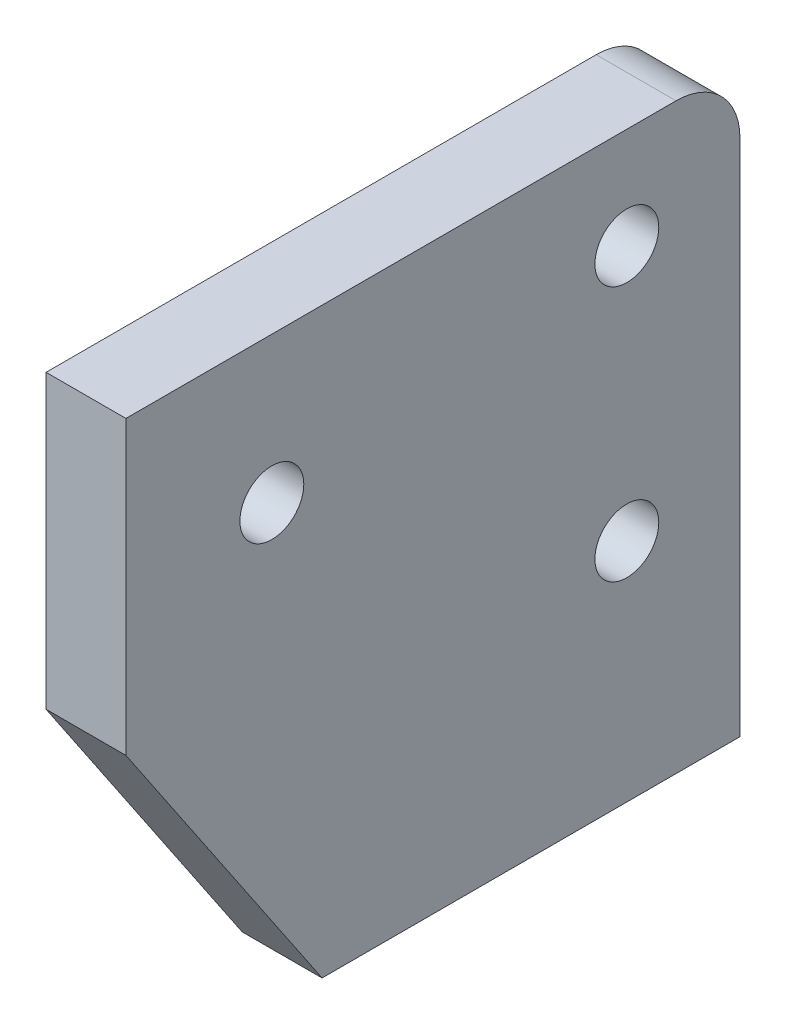
ISO-10303-21;
HEADER;
FILE_DESCRIPTION(('STEP AP214'),'2;1');
FILE_NAME('part.step','',(''),(''),'','','');
FILE_SCHEMA(('AUTOMOTIVE_DESIGN { 1 0 10303 214 1 1 1 1 }'));
ENDSEC;
DATA;
#1=APPLICATION_CONTEXT('core data for automotive mechanical design processes');
#2=APPLICATION_PROTOCOL_DEFINITION('international standard','automotive_design',2000,#1);
#3=PRODUCT_CONTEXT('',#1,'mechanical');
#4=PRODUCT('Part','Part','',(#3));
#5=PRODUCT_RELATED_PRODUCT_CATEGORY('part','',(#4));
#6=PRODUCT_DEFINITION_FORMATION('','',#4);
#7=PRODUCT_DEFINITION_CONTEXT('part definition',#1,'design');
#8=PRODUCT_DEFINITION('design','',#6,#7);
#9=PRODUCT_DEFINITION_SHAPE('','',#8);
#10=(LENGTH_UNIT() NAMED_UNIT(*) SI_UNIT(.MILLI.,.METRE.));
#11=(NAMED_UNIT(*) PLANE_ANGLE_UNIT() SI_UNIT($,.RADIAN.));
#12=(NAMED_UNIT(*) SI_UNIT($,.STERADIAN.) SOLID_ANGLE_UNIT());
#13=UNCERTAINTY_MEASURE_WITH_UNIT(LENGTH_MEASURE(1.E-05),#10,'distance_accuracy_value','');
#14=(GEOMETRIC_REPRESENTATION_CONTEXT(3) GLOBAL_UNCERTAINTY_ASSIGNED_CONTEXT((#13)) GLOBAL_UNIT_ASSIGNED_CONTEXT((#10,
#11,#12)) REPRESENTATION_CONTEXT('',''));
#15=CARTESIAN_POINT('',(0.,0.,0.));
#16=DIRECTION('',(0.,0.,1.));
#17=DIRECTION('',(1.,0.,0.));
#18=AXIS2_PLACEMENT_3D('',#15,#16,#17);
#19=CARTESIAN_POINT('',(3.175,0.,0.));
#20=DIRECTION('',(-1.,0.,0.));
#21=DIRECTION('',(0.,0.,1.));
#22=AXIS2_PLACEMENT_3D('',#19,#20,#21);
#23=PLANE('',#22);
#24=DIRECTION('',(0.,1.,0.));
#25=VECTOR('',#24,1.);
#26=CARTESIAN_POINT('',(3.175,2.62376219694305,-9.84014481352053));
#27=LINE('',#26,#25);
#28=CARTESIAN_POINT('',(3.175,2.62376219694305,-9.84014481352053));
#29=VERTEX_POINT('',#28);
#30=CARTESIAN_POINT('',(3.175,23.2498731492951,-9.84014481352053));
#31=VERTEX_POINT('',#30);
#32=EDGE_CURVE('E88',#29,#31,#27,.T.);
#33=ORIENTED_EDGE('',*,*,#32,.T.);
#34=CARTESIAN_POINT('',(3.175,23.2498731492951,-7.30014481352054));
#35=DIRECTION('',(-1.,0.,0.));
#36=DIRECTION('',(0.,0.,1.));
#37=AXIS2_PLACEMENT_3D('',#34,#35,#36);
#38=CIRCLE('',#37,2.54);
#39=CARTESIAN_POINT('',(3.175,25.7898731492951,-7.30014481352054));
#40=VERTEX_POINT('',#39);
#41=EDGE_CURVE('E11',#31,#40,#38,.F.);
#42=ORIENTED_EDGE('',*,*,#41,.T.);
#43=DIRECTION('',(0.,0.,1.));
#44=VECTOR('',#43,1.);
#45=CARTESIAN_POINT('',(3.175,25.7898731492951,-9.84014481352053));
#46=LINE('',#45,#44);
#47=CARTESIAN_POINT('',(3.175,25.7898731492951,14.5718314721938));
#48=VERTEX_POINT('',#47);
#49=EDGE_CURVE('E105',#40,#48,#46,.T.);
#50=ORIENTED_EDGE('',*,*,#49,.T.);
#51=DIRECTION('',(0.,-1.,0.));
#52=VECTOR('',#51,1.);
#53=CARTESIAN_POINT('',(3.175,14.1873299112288,14.5718314721938));
#54=LINE('',#53,#52);
#55=CARTESIAN_POINT('',(3.175,14.1873299112288,14.5718314721938));
#56=VERTEX_POINT('',#55);
#57=EDGE_CURVE('E107',#48,#56,#54,.T.);
#58=ORIENTED_EDGE('',*,*,#57,.T.);
#59=DIRECTION('',(0.,-0.829091901706567,-0.559112348749863));
#60=VECTOR('',#59,1.);
#61=CARTESIAN_POINT('',(3.175,2.62376219694305,6.77374118647947));
#62=LINE('',#61,#60);
#63=CARTESIAN_POINT('',(3.175,2.62376219694305,6.77374118647947));
#64=VERTEX_POINT('',#63);
#65=EDGE_CURVE('E91',#56,#64,#62,.T.);
#66=ORIENTED_EDGE('',*,*,#65,.T.);
#67=DIRECTION('',(0.,0.,-1.));
#68=VECTOR('',#67,1.);
#69=CARTESIAN_POINT('',(3.175,2.62376219694305,-0.846258813520524));
#70=LINE('',#69,#68);
#71=EDGE_CURVE('E85',#64,#29,#70,.T.);
#72=ORIENTED_EDGE('',*,*,#71,.T.);
#73=EDGE_LOOP('',(#33,#42,#50,#58,#66,#72));
#74=FACE_BOUND('',#73,.T.);
#75=CARTESIAN_POINT('',(3.175,21.777648196943,-5.34320181352053));
#76=DIRECTION('',(1.,0.,0.));
#77=DIRECTION('',(0.,0.,-1.));
#78=AXIS2_PLACEMENT_3D('',#75,#76,#77);
#79=CIRCLE('',#78,1.27);
#80=CARTESIAN_POINT('',(3.175,21.777648196943,-6.61320181352053));
#81=VERTEX_POINT('',#80);
#82=EDGE_CURVE('E116',#81,#81,#79,.T.);
#83=ORIENTED_EDGE('',*,*,#82,.F.);
#84=EDGE_LOOP('',(#83));
#85=FACE_BOUND('',#84,.T.);
#86=CARTESIAN_POINT('',(3.175,11.617648196943,-5.34320181352053));
#87=DIRECTION('',(1.,0.,0.));
#88=DIRECTION('',(0.,0.,-1.));
#89=AXIS2_PLACEMENT_3D('',#86,#87,#88);
#90=CIRCLE('',#89,1.27);
#91=CARTESIAN_POINT('',(3.175,11.617648196943,-6.61320181352053));
#92=VERTEX_POINT('',#91);
#93=EDGE_CURVE('E188',#92,#92,#90,.T.);
#94=ORIENTED_EDGE('',*,*,#93,.F.);
#95=EDGE_LOOP('',(#94));
#96=FACE_BOUND('',#95,.T.);
#97=CARTESIAN_POINT('',(3.175,19.9886015302619,8.77055986419377));
#98=DIRECTION('',(1.,0.,0.));
#99=DIRECTION('',(0.,0.,-1.));
#100=AXIS2_PLACEMENT_3D('',#97,#98,#99);
#101=CIRCLE('',#100,1.27);
#102=CARTESIAN_POINT('',(3.175,19.9886015302619,7.50055986419377));
#103=VERTEX_POINT('',#102);
#104=EDGE_CURVE('E179',#103,#103,#101,.T.);
#105=ORIENTED_EDGE('',*,*,#104,.F.);
#106=EDGE_LOOP('',(#105));
#107=FACE_BOUND('',#106,.T.);
#108=ADVANCED_FACE('F33',(#74,#85,#96,#107),#23,.F.);
#109=CARTESIAN_POINT('',(0.,0.,0.));
#110=DIRECTION('',(-1.,0.,0.));
#111=DIRECTION('',(0.,0.,1.));
#112=AXIS2_PLACEMENT_3D('',#109,#110,#111);
#113=PLANE('',#112);
#114=CARTESIAN_POINT('',(0.,11.617648196943,-5.34320181352053));
#115=DIRECTION('',(1.,0.,0.));
#116=DIRECTION('',(0.,0.,-1.));
#117=AXIS2_PLACEMENT_3D('',#114,#115,#116);
#118=CIRCLE('',#117,1.27);
#119=CARTESIAN_POINT('',(0.,11.617648196943,-6.61320181352053));
#120=VERTEX_POINT('',#119);
#121=EDGE_CURVE('E185',#120,#120,#118,.T.);
#122=ORIENTED_EDGE('',*,*,#121,.T.);
#123=EDGE_LOOP('',(#122));
#124=FACE_BOUND('',#123,.T.);
#125=DIRECTION('',(0.,0.,1.));
#126=VECTOR('',#125,1.);
#127=CARTESIAN_POINT('',(0.,25.7898731492951,14.5718314721938));
#128=LINE('',#127,#126);
#129=CARTESIAN_POINT('',(0.,25.7898731492951,-7.30014481352053));
#130=VERTEX_POINT('',#129);
#131=CARTESIAN_POINT('',(0.,25.7898731492951,14.5718314721938));
#132=VERTEX_POINT('',#131);
#133=EDGE_CURVE('E118',#130,#132,#128,.T.);
#134=ORIENTED_EDGE('',*,*,#133,.F.);
#135=CARTESIAN_POINT('',(0.,23.2498731492951,-7.30014481352054));
#136=DIRECTION('',(-1.,0.,0.));
#137=DIRECTION('',(0.,0.,1.));
#138=AXIS2_PLACEMENT_3D('',#135,#136,#137);
#139=CIRCLE('',#138,2.54);
#140=CARTESIAN_POINT('',(0.,23.2498731492951,-9.84014481352053));
#141=VERTEX_POINT('',#140);
#142=EDGE_CURVE('E55',#130,#141,#139,.T.);
#143=ORIENTED_EDGE('',*,*,#142,.T.);
#144=DIRECTION('',(0.,1.,0.));
#145=VECTOR('',#144,1.);
#146=CARTESIAN_POINT('',(0.,2.62376219694305,-9.84014481352053));
#147=LINE('',#146,#145);
#148=CARTESIAN_POINT('',(0.,2.62376219694305,-9.84014481352053));
#149=VERTEX_POINT('',#148);
#150=EDGE_CURVE('E115',#149,#141,#147,.T.);
#151=ORIENTED_EDGE('',*,*,#150,.F.);
#152=DIRECTION('',(0.,0.,-1.));
#153=VECTOR('',#152,1.);
#154=CARTESIAN_POINT('',(0.,2.62376219694305,-0.846258813520524));
#155=LINE('',#154,#153);
#156=CARTESIAN_POINT('',(0.,2.62376219694305,6.77374118647947));
#157=VERTEX_POINT('',#156);
#158=EDGE_CURVE('E100',#157,#149,#155,.T.);
#159=ORIENTED_EDGE('',*,*,#158,.F.);
#160=DIRECTION('',(0.,-0.829091901706567,-0.559112348749863));
#161=VECTOR('',#160,1.);
#162=CARTESIAN_POINT('',(0.,2.62376219694305,6.77374118647947));
#163=LINE('',#162,#161);
#164=CARTESIAN_POINT('',(0.,14.1873299112288,14.5718314721938));
#165=VERTEX_POINT('',#164);
#166=EDGE_CURVE('E95',#165,#157,#163,.T.);
#167=ORIENTED_EDGE('',*,*,#166,.F.);
#168=DIRECTION('',(0.,-1.,0.));
#169=VECTOR('',#168,1.);
#170=CARTESIAN_POINT('',(0.,14.1873299112288,14.5718314721938));
#171=LINE('',#170,#169);
#172=EDGE_CURVE('E120',#132,#165,#171,.T.);
#173=ORIENTED_EDGE('',*,*,#172,.F.);
#174=EDGE_LOOP('',(#134,#143,#151,#159,#167,#173));
#175=FACE_BOUND('',#174,.T.);
#176=CARTESIAN_POINT('',(0.,21.777648196943,-5.34320181352053));
#177=DIRECTION('',(1.,0.,0.));
#178=DIRECTION('',(0.,0.,-1.));
#179=AXIS2_PLACEMENT_3D('',#176,#177,#178);
#180=CIRCLE('',#179,1.27);
#181=CARTESIAN_POINT('',(0.,21.777648196943,-6.61320181352053));
#182=VERTEX_POINT('',#181);
#183=EDGE_CURVE('E191',#182,#182,#180,.T.);
#184=ORIENTED_EDGE('',*,*,#183,.T.);
#185=EDGE_LOOP('',(#184));
#186=FACE_BOUND('',#185,.T.);
#187=CARTESIAN_POINT('',(0.,19.9886015302619,8.77055986419377));
#188=DIRECTION('',(1.,0.,0.));
#189=DIRECTION('',(0.,0.,-1.));
#190=AXIS2_PLACEMENT_3D('',#187,#188,#189);
#191=CIRCLE('',#190,1.27);
#192=CARTESIAN_POINT('',(0.,19.9886015302619,7.50055986419377));
#193=VERTEX_POINT('',#192);
#194=EDGE_CURVE('E182',#193,#193,#191,.T.);
#195=ORIENTED_EDGE('',*,*,#194,.T.);
#196=EDGE_LOOP('',(#195));
#197=FACE_BOUND('',#196,.T.);
#198=ADVANCED_FACE('F139',(#124,#175,#186,#197),#113,.T.);
#199=CARTESIAN_POINT('',(3.175,2.62376219694305,-0.846258813520524));
#200=DIRECTION('',(0.,1.,0.));
#201=DIRECTION('',(0.,0.,1.));
#202=AXIS2_PLACEMENT_3D('',#199,#200,#201);
#203=PLANE('',#202);
#204=ORIENTED_EDGE('',*,*,#158,.T.);
#205=DIRECTION('',(-1.,0.,0.));
#206=VECTOR('',#205,1.);
#207=CARTESIAN_POINT('',(3.175,2.62376219694305,-9.84014481352053));
#208=LINE('',#207,#206);
#209=EDGE_CURVE('E98',#29,#149,#208,.T.);
#210=ORIENTED_EDGE('',*,*,#209,.F.);
#211=ORIENTED_EDGE('',*,*,#71,.F.);
#212=DIRECTION('',(-1.,0.,0.));
#213=VECTOR('',#212,1.);
#214=CARTESIAN_POINT('',(3.175,2.62376219694305,6.77374118647947));
#215=LINE('',#214,#213);
#216=EDGE_CURVE('E113',#64,#157,#215,.T.);
#217=ORIENTED_EDGE('',*,*,#216,.T.);
#218=EDGE_LOOP('',(#204,#210,#211,#217));
#219=FACE_BOUND('',#218,.T.);
#220=ADVANCED_FACE('F99',(#219),#203,.F.);
#221=CARTESIAN_POINT('',(3.175,2.62376219694305,-9.84014481352053));
#222=DIRECTION('',(0.,0.,1.));
#223=DIRECTION('',(1.,0.,0.));
#224=AXIS2_PLACEMENT_3D('',#221,#222,#223);
#225=PLANE('',#224);
#226=ORIENTED_EDGE('',*,*,#150,.T.);
#227=DIRECTION('',(-1.,0.,0.));
#228=VECTOR('',#227,1.);
#229=CARTESIAN_POINT('',(3.175,23.2498731492951,-9.84014481352053));
#230=LINE('',#229,#228);
#231=EDGE_CURVE('E41',#141,#31,#230,.F.);
#232=ORIENTED_EDGE('',*,*,#231,.T.);
#233=ORIENTED_EDGE('',*,*,#32,.F.);
#234=ORIENTED_EDGE('',*,*,#209,.T.);
#235=EDGE_LOOP('',(#226,#232,#233,#234));
#236=FACE_BOUND('',#235,.T.);
#237=ADVANCED_FACE('F104',(#236),#225,.F.);
#238=CARTESIAN_POINT('',(3.175,25.7898731492951,14.5718314721938));
#239=DIRECTION('',(0.,-1.,0.));
#240=DIRECTION('',(0.,0.,-1.));
#241=AXIS2_PLACEMENT_3D('',#238,#239,#240);
#242=PLANE('',#241);
#243=ORIENTED_EDGE('',*,*,#49,.F.);
#244=DIRECTION('',(-1.,0.,0.));
#245=VECTOR('',#244,1.);
#246=CARTESIAN_POINT('',(3.175,25.7898731492951,-7.30014481352054));
#247=LINE('',#246,#245);
#248=EDGE_CURVE('E101',#40,#130,#247,.T.);
#249=ORIENTED_EDGE('',*,*,#248,.T.);
#250=ORIENTED_EDGE('',*,*,#133,.T.);
#251=DIRECTION('',(-1.,0.,0.));
#252=VECTOR('',#251,1.);
#253=CARTESIAN_POINT('',(3.175,25.7898731492951,14.5718314721938));
#254=LINE('',#253,#252);
#255=EDGE_CURVE('E102',#48,#132,#254,.T.);
#256=ORIENTED_EDGE('',*,*,#255,.F.);
#257=EDGE_LOOP('',(#243,#249,#250,#256));
#258=FACE_BOUND('',#257,.T.);
#259=ADVANCED_FACE('F135',(#258),#242,.F.);
#260=CARTESIAN_POINT('',(3.175,14.1873299112288,14.5718314721938));
#261=DIRECTION('',(0.,0.,-1.));
#262=DIRECTION('',(-1.,0.,0.));
#263=AXIS2_PLACEMENT_3D('',#260,#261,#262);
#264=PLANE('',#263);
#265=ORIENTED_EDGE('',*,*,#172,.T.);
#266=DIRECTION('',(-1.,0.,0.));
#267=VECTOR('',#266,1.);
#268=CARTESIAN_POINT('',(3.175,14.1873299112288,14.5718314721938));
#269=LINE('',#268,#267);
#270=EDGE_CURVE('E125',#56,#165,#269,.T.);
#271=ORIENTED_EDGE('',*,*,#270,.F.);
#272=ORIENTED_EDGE('',*,*,#57,.F.);
#273=ORIENTED_EDGE('',*,*,#255,.T.);
#274=EDGE_LOOP('',(#265,#271,#272,#273));
#275=FACE_BOUND('',#274,.T.);
#276=ADVANCED_FACE('F144',(#275),#264,.F.);
#277=CARTESIAN_POINT('',(3.175,2.62376219694305,6.77374118647947));
#278=DIRECTION('',(0.,0.559112348749863,-0.829091901706567));
#279=DIRECTION('',(0.,0.829091901706567,0.559112348749863));
#280=AXIS2_PLACEMENT_3D('',#277,#278,#279);
#281=PLANE('',#280);
#282=ORIENTED_EDGE('',*,*,#166,.T.);
#283=ORIENTED_EDGE('',*,*,#216,.F.);
#284=ORIENTED_EDGE('',*,*,#65,.F.);
#285=ORIENTED_EDGE('',*,*,#270,.T.);
#286=EDGE_LOOP('',(#282,#283,#284,#285));
#287=FACE_BOUND('',#286,.T.);
#288=ADVANCED_FACE('F147',(#287),#281,.F.);
#289=CARTESIAN_POINT('',(3.175,21.777648196943,-5.34320181352053));
#290=DIRECTION('',(-1.,0.,0.));
#291=DIRECTION('',(0.,0.,1.));
#292=AXIS2_PLACEMENT_3D('',#289,#290,#291);
#293=CYLINDRICAL_SURFACE('',#292,1.27);
#294=ORIENTED_EDGE('',*,*,#82,.T.);
#295=EDGE_LOOP('',(#294));
#296=FACE_BOUND('',#295,.T.);
#297=ORIENTED_EDGE('',*,*,#183,.F.);
#298=EDGE_LOOP('',(#297));
#299=FACE_BOUND('',#298,.T.);
#300=ADVANCED_FACE('F149',(#296,#299),#293,.F.);
#301=CARTESIAN_POINT('',(3.175,11.617648196943,-5.34320181352053));
#302=DIRECTION('',(-1.,0.,0.));
#303=DIRECTION('',(0.,0.,1.));
#304=AXIS2_PLACEMENT_3D('',#301,#302,#303);
#305=CYLINDRICAL_SURFACE('',#304,1.27);
#306=ORIENTED_EDGE('',*,*,#93,.T.);
#307=EDGE_LOOP('',(#306));
#308=FACE_BOUND('',#307,.T.);
#309=ORIENTED_EDGE('',*,*,#121,.F.);
#310=EDGE_LOOP('',(#309));
#311=FACE_BOUND('',#310,.T.);
#312=ADVANCED_FACE('F155',(#308,#311),#305,.F.);
#313=CARTESIAN_POINT('',(3.175,19.9886015302619,8.77055986419377));
#314=DIRECTION('',(-1.,0.,0.));
#315=DIRECTION('',(0.,0.,1.));
#316=AXIS2_PLACEMENT_3D('',#313,#314,#315);
#317=CYLINDRICAL_SURFACE('',#316,1.27);
#318=ORIENTED_EDGE('',*,*,#104,.T.);
#319=EDGE_LOOP('',(#318));
#320=FACE_BOUND('',#319,.T.);
#321=ORIENTED_EDGE('',*,*,#194,.F.);
#322=EDGE_LOOP('',(#321));
#323=FACE_BOUND('',#322,.T.);
#324=ADVANCED_FACE('F169',(#320,#323),#317,.F.);
#325=CARTESIAN_POINT('',(3.175,23.2498731492951,-7.30014481352054));
#326=DIRECTION('',(-1.,0.,0.));
#327=DIRECTION('',(0.,0.,1.));
#328=AXIS2_PLACEMENT_3D('',#325,#326,#327);
#329=CYLINDRICAL_SURFACE('',#328,2.54);
#330=ORIENTED_EDGE('',*,*,#41,.F.);
#331=ORIENTED_EDGE('',*,*,#231,.F.);
#332=ORIENTED_EDGE('',*,*,#142,.F.);
#333=ORIENTED_EDGE('',*,*,#248,.F.);
#334=EDGE_LOOP('',(#330,#331,#332,#333));
#335=FACE_BOUND('',#334,.T.);
#336=ADVANCED_FACE('F35',(#335),#329,.T.);
#337=CLOSED_SHELL('',(#108,#198,#220,#237,#259,#276,#288,#300,#312,#324,#336));
#338=MANIFOLD_SOLID_BREP('B2',#337);
#339=ADVANCED_BREP_SHAPE_REPRESENTATION('',(#18,#338),#14);
#340=SHAPE_DEFINITION_REPRESENTATION(#9,#339);
ENDSEC;
END-ISO-10303-21;
